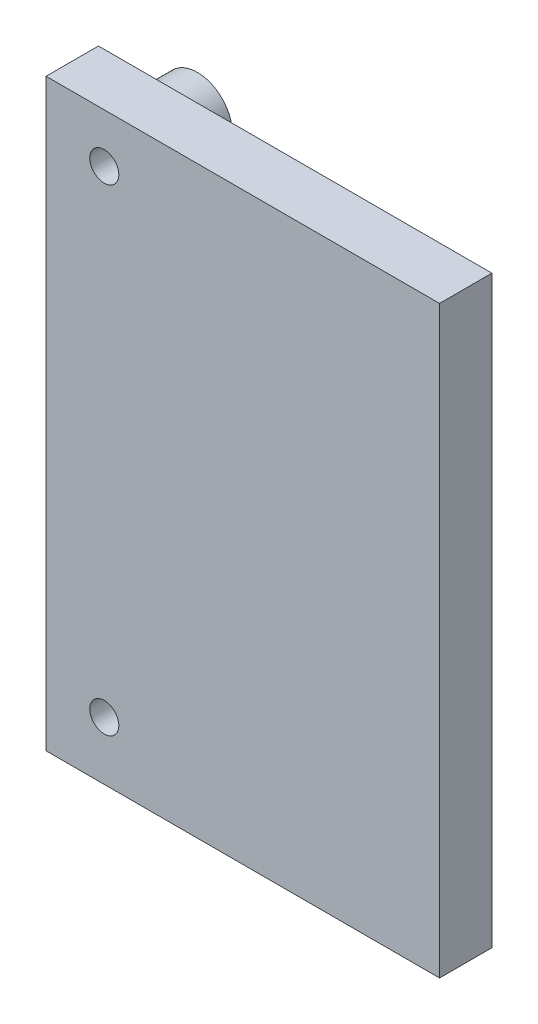
ISO-10303-21;
HEADER;
FILE_DESCRIPTION(('STEP AP214'),'2;1');
FILE_NAME('part.step','',(''),(''),'','','');
FILE_SCHEMA(('AUTOMOTIVE_DESIGN { 1 0 10303 214 1 1 1 1 }'));
ENDSEC;
DATA;
#1=APPLICATION_CONTEXT('core data for automotive mechanical design processes');
#2=APPLICATION_PROTOCOL_DEFINITION('international standard','automotive_design',2000,#1);
#3=PRODUCT_CONTEXT('',#1,'mechanical');
#4=PRODUCT('Part','Part','',(#3));
#5=PRODUCT_RELATED_PRODUCT_CATEGORY('part','',(#4));
#6=PRODUCT_DEFINITION_FORMATION('','',#4);
#7=PRODUCT_DEFINITION_CONTEXT('part definition',#1,'design');
#8=PRODUCT_DEFINITION('design','',#6,#7);
#9=PRODUCT_DEFINITION_SHAPE('','',#8);
#10=(LENGTH_UNIT() NAMED_UNIT(*) SI_UNIT(.MILLI.,.METRE.));
#11=(NAMED_UNIT(*) PLANE_ANGLE_UNIT() SI_UNIT($,.RADIAN.));
#12=(NAMED_UNIT(*) SI_UNIT($,.STERADIAN.) SOLID_ANGLE_UNIT());
#13=UNCERTAINTY_MEASURE_WITH_UNIT(LENGTH_MEASURE(1.E-05),#10,'distance_accuracy_value','');
#14=(GEOMETRIC_REPRESENTATION_CONTEXT(3) GLOBAL_UNCERTAINTY_ASSIGNED_CONTEXT((#13)) GLOBAL_UNIT_ASSIGNED_CONTEXT((#10,
#11,#12)) REPRESENTATION_CONTEXT('',''));
#15=CARTESIAN_POINT('',(0.,0.,0.));
#16=DIRECTION('',(0.,0.,1.));
#17=DIRECTION('',(1.,0.,0.));
#18=AXIS2_PLACEMENT_3D('',#15,#16,#17);
#19=CARTESIAN_POINT('',(81.,-120.,4.5));
#20=DIRECTION('',(1.,0.,0.));
#21=DIRECTION('',(0.,0.,-1.));
#22=AXIS2_PLACEMENT_3D('',#19,#20,#21);
#23=PLANE('',#22);
#24=DIRECTION('',(0.,-1.,0.));
#25=VECTOR('',#24,1.);
#26=CARTESIAN_POINT('',(81.,-120.,0.));
#27=LINE('',#26,#25);
#28=CARTESIAN_POINT('',(81.,-69.7929521045972,0.));
#29=VERTEX_POINT('',#28);
#30=CARTESIAN_POINT('',(81.,-120.,0.));
#31=VERTEX_POINT('',#30);
#32=EDGE_CURVE('E131',#29,#31,#27,.T.);
#33=ORIENTED_EDGE('',*,*,#32,.T.);
#34=DIRECTION('',(0.,0.,-1.));
#35=VECTOR('',#34,1.);
#36=CARTESIAN_POINT('',(81.,-120.,4.5));
#37=LINE('',#36,#35);
#38=CARTESIAN_POINT('',(81.,-120.,4.5));
#39=VERTEX_POINT('',#38);
#40=EDGE_CURVE('E11',#39,#31,#37,.T.);
#41=ORIENTED_EDGE('',*,*,#40,.F.);
#42=DIRECTION('',(0.,-1.,0.));
#43=VECTOR('',#42,1.);
#44=CARTESIAN_POINT('',(81.,-120.,4.5));
#45=LINE('',#44,#43);
#46=CARTESIAN_POINT('',(81.,-69.7929521045972,4.5));
#47=VERTEX_POINT('',#46);
#48=EDGE_CURVE('E142',#47,#39,#45,.T.);
#49=ORIENTED_EDGE('',*,*,#48,.F.);
#50=DIRECTION('',(0.,0.,-1.));
#51=VECTOR('',#50,1.);
#52=CARTESIAN_POINT('',(81.,-69.7929521045972,4.5));
#53=LINE('',#52,#51);
#54=EDGE_CURVE('E155',#47,#29,#53,.T.);
#55=ORIENTED_EDGE('',*,*,#54,.T.);
#56=EDGE_LOOP('',(#33,#41,#49,#55));
#57=FACE_BOUND('',#56,.T.);
#58=ADVANCED_FACE('F43',(#57),#23,.F.);
#59=CARTESIAN_POINT('',(81.,-120.,4.5));
#60=DIRECTION('',(0.,1.,0.));
#61=DIRECTION('',(0.,0.,1.));
#62=AXIS2_PLACEMENT_3D('',#59,#60,#61);
#63=PLANE('',#62);
#64=DIRECTION('',(1.,0.,0.));
#65=VECTOR('',#64,1.);
#66=CARTESIAN_POINT('',(81.,-120.,0.));
#67=LINE('',#66,#65);
#68=CARTESIAN_POINT('',(114.813849948849,-120.,0.));
#69=VERTEX_POINT('',#68);
#70=EDGE_CURVE('E136',#31,#69,#67,.T.);
#71=ORIENTED_EDGE('',*,*,#70,.T.);
#72=DIRECTION('',(0.,0.,-1.));
#73=VECTOR('',#72,1.);
#74=CARTESIAN_POINT('',(114.813849948849,-120.,4.5));
#75=LINE('',#74,#73);
#76=CARTESIAN_POINT('',(114.813849948849,-120.,4.5));
#77=VERTEX_POINT('',#76);
#78=EDGE_CURVE('E51',#77,#69,#75,.T.);
#79=ORIENTED_EDGE('',*,*,#78,.F.);
#80=DIRECTION('',(1.,0.,0.));
#81=VECTOR('',#80,1.);
#82=CARTESIAN_POINT('',(81.,-120.,4.5));
#83=LINE('',#82,#81);
#84=EDGE_CURVE('E146',#39,#77,#83,.T.);
#85=ORIENTED_EDGE('',*,*,#84,.F.);
#86=ORIENTED_EDGE('',*,*,#40,.T.);
#87=EDGE_LOOP('',(#71,#79,#85,#86));
#88=FACE_BOUND('',#87,.T.);
#89=ADVANCED_FACE('F192',(#88),#63,.F.);
#90=CARTESIAN_POINT('',(114.813849948849,-120.,4.5));
#91=DIRECTION('',(-1.,0.,0.));
#92=DIRECTION('',(0.,0.,1.));
#93=AXIS2_PLACEMENT_3D('',#90,#91,#92);
#94=PLANE('',#93);
#95=DIRECTION('',(0.,1.,0.));
#96=VECTOR('',#95,1.);
#97=CARTESIAN_POINT('',(114.813849948849,-120.,0.));
#98=LINE('',#97,#96);
#99=CARTESIAN_POINT('',(114.813849948849,-69.7929521045972,0.));
#100=VERTEX_POINT('',#99);
#101=EDGE_CURVE('E159',#69,#100,#98,.T.);
#102=ORIENTED_EDGE('',*,*,#101,.T.);
#103=DIRECTION('',(0.,0.,-1.));
#104=VECTOR('',#103,1.);
#105=CARTESIAN_POINT('',(114.813849948849,-69.7929521045972,4.5));
#106=LINE('',#105,#104);
#107=CARTESIAN_POINT('',(114.813849948849,-69.7929521045972,4.5));
#108=VERTEX_POINT('',#107);
#109=EDGE_CURVE('E167',#108,#100,#106,.T.);
#110=ORIENTED_EDGE('',*,*,#109,.F.);
#111=DIRECTION('',(0.,1.,0.));
#112=VECTOR('',#111,1.);
#113=CARTESIAN_POINT('',(114.813849948849,-120.,4.5));
#114=LINE('',#113,#112);
#115=EDGE_CURVE('E150',#77,#108,#114,.T.);
#116=ORIENTED_EDGE('',*,*,#115,.F.);
#117=ORIENTED_EDGE('',*,*,#78,.T.);
#118=EDGE_LOOP('',(#102,#110,#116,#117));
#119=FACE_BOUND('',#118,.T.);
#120=ADVANCED_FACE('F176',(#119),#94,.F.);
#121=CARTESIAN_POINT('',(81.,-69.7929521045972,4.5));
#122=DIRECTION('',(0.,-1.,0.));
#123=DIRECTION('',(0.,0.,-1.));
#124=AXIS2_PLACEMENT_3D('',#121,#122,#123);
#125=PLANE('',#124);
#126=DIRECTION('',(-1.,0.,0.));
#127=VECTOR('',#126,1.);
#128=CARTESIAN_POINT('',(81.,-69.7929521045972,0.));
#129=LINE('',#128,#127);
#130=EDGE_CURVE('E147',#100,#29,#129,.T.);
#131=ORIENTED_EDGE('',*,*,#130,.T.);
#132=ORIENTED_EDGE('',*,*,#54,.F.);
#133=DIRECTION('',(-1.,0.,0.));
#134=VECTOR('',#133,1.);
#135=CARTESIAN_POINT('',(81.,-69.7929521045972,4.5));
#136=LINE('',#135,#134);
#137=EDGE_CURVE('E153',#108,#47,#136,.T.);
#138=ORIENTED_EDGE('',*,*,#137,.F.);
#139=ORIENTED_EDGE('',*,*,#109,.T.);
#140=EDGE_LOOP('',(#131,#132,#138,#139));
#141=FACE_BOUND('',#140,.T.);
#142=ADVANCED_FACE('F185',(#141),#125,.F.);
#143=CARTESIAN_POINT('',(0.,0.,4.5));
#144=DIRECTION('',(0.,0.,-1.));
#145=DIRECTION('',(-1.,0.,0.));
#146=AXIS2_PLACEMENT_3D('',#143,#144,#145);
#147=PLANE('',#146);
#148=CARTESIAN_POINT('',(86.,-74.,4.5));
#149=DIRECTION('',(0.,0.,-1.));
#150=DIRECTION('',(-1.,0.,0.));
#151=AXIS2_PLACEMENT_3D('',#148,#149,#150);
#152=CIRCLE('',#151,1.25);
#153=CARTESIAN_POINT('',(84.75,-74.,4.5));
#154=VERTEX_POINT('',#153);
#155=EDGE_CURVE('E250',#154,#154,#152,.T.);
#156=ORIENTED_EDGE('',*,*,#155,.T.);
#157=EDGE_LOOP('',(#156));
#158=FACE_BOUND('',#157,.T.);
#159=CARTESIAN_POINT('',(86.,-115.,4.5));
#160=DIRECTION('',(0.,0.,-1.));
#161=DIRECTION('',(-1.,0.,0.));
#162=AXIS2_PLACEMENT_3D('',#159,#160,#161);
#163=CIRCLE('',#162,1.25);
#164=CARTESIAN_POINT('',(84.75,-115.,4.5));
#165=VERTEX_POINT('',#164);
#166=EDGE_CURVE('E263',#165,#165,#163,.T.);
#167=ORIENTED_EDGE('',*,*,#166,.T.);
#168=EDGE_LOOP('',(#167));
#169=FACE_BOUND('',#168,.T.);
#170=ORIENTED_EDGE('',*,*,#48,.T.);
#171=ORIENTED_EDGE('',*,*,#84,.T.);
#172=ORIENTED_EDGE('',*,*,#115,.T.);
#173=ORIENTED_EDGE('',*,*,#137,.T.);
#174=EDGE_LOOP('',(#170,#171,#172,#173));
#175=FACE_BOUND('',#174,.T.);
#176=ADVANCED_FACE('F191',(#158,#169,#175),#147,.F.);
#177=CARTESIAN_POINT('',(0.,0.,0.));
#178=DIRECTION('',(0.,0.,-1.));
#179=DIRECTION('',(-1.,0.,0.));
#180=AXIS2_PLACEMENT_3D('',#177,#178,#179);
#181=PLANE('',#180);
#182=CARTESIAN_POINT('',(86.,-74.,0.));
#183=DIRECTION('',(0.,0.,-1.));
#184=DIRECTION('',(-1.,0.,0.));
#185=AXIS2_PLACEMENT_3D('',#182,#183,#184);
#186=CIRCLE('',#185,3.00000000000001);
#187=CARTESIAN_POINT('',(83.,-74.,0.));
#188=VERTEX_POINT('',#187);
#189=EDGE_CURVE('E267',#188,#188,#186,.T.);
#190=ORIENTED_EDGE('',*,*,#189,.F.);
#191=EDGE_LOOP('',(#190));
#192=FACE_BOUND('',#191,.T.);
#193=CARTESIAN_POINT('',(86.,-115.,0.));
#194=DIRECTION('',(0.,0.,-1.));
#195=DIRECTION('',(-1.,0.,0.));
#196=AXIS2_PLACEMENT_3D('',#193,#194,#195);
#197=CIRCLE('',#196,3.00000000000001);
#198=CARTESIAN_POINT('',(83.,-115.,0.));
#199=VERTEX_POINT('',#198);
#200=EDGE_CURVE('E272',#199,#199,#197,.T.);
#201=ORIENTED_EDGE('',*,*,#200,.F.);
#202=EDGE_LOOP('',(#201));
#203=FACE_BOUND('',#202,.T.);
#204=DIRECTION('',(0.,-1.,0.));
#205=VECTOR('',#204,1.);
#206=CARTESIAN_POINT('',(112.202559130168,-80.042,0.));
#207=LINE('',#206,#205);
#208=CARTESIAN_POINT('',(112.202559130168,-80.042,0.));
#209=VERTEX_POINT('',#208);
#210=CARTESIAN_POINT('',(112.202559130168,-109.,0.));
#211=VERTEX_POINT('',#210);
#212=EDGE_CURVE('E58',#209,#211,#207,.T.);
#213=ORIENTED_EDGE('',*,*,#212,.F.);
#214=DIRECTION('',(1.,0.,0.));
#215=VECTOR('',#214,1.);
#216=CARTESIAN_POINT('',(112.202559130168,-80.042,0.));
#217=LINE('',#216,#215);
#218=CARTESIAN_POINT('',(85.498,-80.042,0.));
#219=VERTEX_POINT('',#218);
#220=EDGE_CURVE('E62',#219,#209,#217,.T.);
#221=ORIENTED_EDGE('',*,*,#220,.F.);
#222=DIRECTION('',(0.,1.,0.));
#223=VECTOR('',#222,1.);
#224=CARTESIAN_POINT('',(85.498,-80.042,0.));
#225=LINE('',#224,#223);
#226=CARTESIAN_POINT('',(85.498,-109.,0.));
#227=VERTEX_POINT('',#226);
#228=EDGE_CURVE('E293',#227,#219,#225,.T.);
#229=ORIENTED_EDGE('',*,*,#228,.F.);
#230=DIRECTION('',(-1.,0.,0.));
#231=VECTOR('',#230,1.);
#232=CARTESIAN_POINT('',(112.202559130168,-109.,0.));
#233=LINE('',#232,#231);
#234=EDGE_CURVE('E290',#211,#227,#233,.T.);
#235=ORIENTED_EDGE('',*,*,#234,.F.);
#236=EDGE_LOOP('',(#213,#221,#229,#235));
#237=FACE_BOUND('',#236,.T.);
#238=ORIENTED_EDGE('',*,*,#32,.F.);
#239=ORIENTED_EDGE('',*,*,#130,.F.);
#240=ORIENTED_EDGE('',*,*,#101,.F.);
#241=ORIENTED_EDGE('',*,*,#70,.F.);
#242=EDGE_LOOP('',(#238,#239,#240,#241));
#243=FACE_BOUND('',#242,.T.);
#244=ADVANCED_FACE('F182',(#192,#203,#237,#243),#181,.T.);
#245=CARTESIAN_POINT('',(112.202559130168,-80.042,-1.5));
#246=DIRECTION('',(-1.,0.,0.));
#247=DIRECTION('',(0.,0.,1.));
#248=AXIS2_PLACEMENT_3D('',#245,#246,#247);
#249=PLANE('',#248);
#250=ORIENTED_EDGE('',*,*,#212,.T.);
#251=DIRECTION('',(0.,0.,1.));
#252=VECTOR('',#251,1.);
#253=CARTESIAN_POINT('',(112.202559130168,-109.,-1.5));
#254=LINE('',#253,#252);
#255=CARTESIAN_POINT('',(112.202559130168,-109.,-1.5));
#256=VERTEX_POINT('',#255);
#257=EDGE_CURVE('E111',#256,#211,#254,.T.);
#258=ORIENTED_EDGE('',*,*,#257,.F.);
#259=DIRECTION('',(0.,-1.,0.));
#260=VECTOR('',#259,1.);
#261=CARTESIAN_POINT('',(112.202559130168,-80.042,-1.5));
#262=LINE('',#261,#260);
#263=CARTESIAN_POINT('',(112.202559130168,-80.042,-1.5));
#264=VERTEX_POINT('',#263);
#265=EDGE_CURVE('E118',#264,#256,#262,.T.);
#266=ORIENTED_EDGE('',*,*,#265,.F.);
#267=DIRECTION('',(0.,0.,1.));
#268=VECTOR('',#267,1.);
#269=CARTESIAN_POINT('',(112.202559130168,-80.042,-1.5));
#270=LINE('',#269,#268);
#271=EDGE_CURVE('E287',#264,#209,#270,.T.);
#272=ORIENTED_EDGE('',*,*,#271,.T.);
#273=EDGE_LOOP('',(#250,#258,#266,#272));
#274=FACE_BOUND('',#273,.T.);
#275=ADVANCED_FACE('F129',(#274),#249,.F.);
#276=CARTESIAN_POINT('',(112.202559130168,-109.,-1.5));
#277=DIRECTION('',(0.,1.,0.));
#278=DIRECTION('',(0.,0.,1.));
#279=AXIS2_PLACEMENT_3D('',#276,#277,#278);
#280=PLANE('',#279);
#281=ORIENTED_EDGE('',*,*,#234,.T.);
#282=DIRECTION('',(0.,0.,1.));
#283=VECTOR('',#282,1.);
#284=CARTESIAN_POINT('',(85.498,-109.,-1.5));
#285=LINE('',#284,#283);
#286=CARTESIAN_POINT('',(85.498,-109.,-1.5));
#287=VERTEX_POINT('',#286);
#288=EDGE_CURVE('E113',#287,#227,#285,.T.);
#289=ORIENTED_EDGE('',*,*,#288,.F.);
#290=DIRECTION('',(-1.,0.,0.));
#291=VECTOR('',#290,1.);
#292=CARTESIAN_POINT('',(112.202559130168,-109.,-1.5));
#293=LINE('',#292,#291);
#294=EDGE_CURVE('E106',#256,#287,#293,.T.);
#295=ORIENTED_EDGE('',*,*,#294,.F.);
#296=ORIENTED_EDGE('',*,*,#257,.T.);
#297=EDGE_LOOP('',(#281,#289,#295,#296));
#298=FACE_BOUND('',#297,.T.);
#299=ADVANCED_FACE('F109',(#298),#280,.F.);
#300=CARTESIAN_POINT('',(85.498,-80.042,-1.5));
#301=DIRECTION('',(1.,0.,0.));
#302=DIRECTION('',(0.,0.,-1.));
#303=AXIS2_PLACEMENT_3D('',#300,#301,#302);
#304=PLANE('',#303);
#305=ORIENTED_EDGE('',*,*,#228,.T.);
#306=DIRECTION('',(0.,0.,1.));
#307=VECTOR('',#306,1.);
#308=CARTESIAN_POINT('',(85.498,-80.042,-1.5));
#309=LINE('',#308,#307);
#310=CARTESIAN_POINT('',(85.498,-80.042,-1.5));
#311=VERTEX_POINT('',#310);
#312=EDGE_CURVE('E138',#311,#219,#309,.T.);
#313=ORIENTED_EDGE('',*,*,#312,.F.);
#314=DIRECTION('',(0.,1.,0.));
#315=VECTOR('',#314,1.);
#316=CARTESIAN_POINT('',(85.498,-80.042,-1.5));
#317=LINE('',#316,#315);
#318=EDGE_CURVE('E117',#287,#311,#317,.T.);
#319=ORIENTED_EDGE('',*,*,#318,.F.);
#320=ORIENTED_EDGE('',*,*,#288,.T.);
#321=EDGE_LOOP('',(#305,#313,#319,#320));
#322=FACE_BOUND('',#321,.T.);
#323=ADVANCED_FACE('F212',(#322),#304,.F.);
#324=CARTESIAN_POINT('',(112.202559130168,-80.042,-1.5));
#325=DIRECTION('',(0.,-1.,0.));
#326=DIRECTION('',(0.,0.,-1.));
#327=AXIS2_PLACEMENT_3D('',#324,#325,#326);
#328=PLANE('',#327);
#329=ORIENTED_EDGE('',*,*,#220,.T.);
#330=ORIENTED_EDGE('',*,*,#271,.F.);
#331=DIRECTION('',(1.,0.,0.));
#332=VECTOR('',#331,1.);
#333=CARTESIAN_POINT('',(112.202559130168,-80.042,-1.5));
#334=LINE('',#333,#332);
#335=EDGE_CURVE('E123',#311,#264,#334,.T.);
#336=ORIENTED_EDGE('',*,*,#335,.F.);
#337=ORIENTED_EDGE('',*,*,#312,.T.);
#338=EDGE_LOOP('',(#329,#330,#336,#337));
#339=FACE_BOUND('',#338,.T.);
#340=ADVANCED_FACE('F215',(#339),#328,.F.);
#341=CARTESIAN_POINT('',(0.,0.,-1.5));
#342=DIRECTION('',(0.,0.,-1.));
#343=DIRECTION('',(-1.,0.,0.));
#344=AXIS2_PLACEMENT_3D('',#341,#342,#343);
#345=PLANE('',#344);
#346=ORIENTED_EDGE('',*,*,#265,.T.);
#347=ORIENTED_EDGE('',*,*,#294,.T.);
#348=ORIENTED_EDGE('',*,*,#318,.T.);
#349=ORIENTED_EDGE('',*,*,#335,.T.);
#350=EDGE_LOOP('',(#346,#347,#348,#349));
#351=FACE_BOUND('',#350,.T.);
#352=ADVANCED_FACE('F121',(#351),#345,.T.);
#353=CARTESIAN_POINT('',(86.,-115.,-3.5));
#354=DIRECTION('',(0.,0.,1.));
#355=DIRECTION('',(1.,0.,0.));
#356=AXIS2_PLACEMENT_3D('',#353,#354,#355);
#357=CYLINDRICAL_SURFACE('',#356,3.00000000000001);
#358=CARTESIAN_POINT('',(86.,-115.,-3.5));
#359=DIRECTION('',(0.,0.,-1.));
#360=DIRECTION('',(-1.,0.,0.));
#361=AXIS2_PLACEMENT_3D('',#358,#359,#360);
#362=CIRCLE('',#361,3.00000000000001);
#363=CARTESIAN_POINT('',(83.,-115.,-3.5));
#364=VERTEX_POINT('',#363);
#365=EDGE_CURVE('E276',#364,#364,#362,.T.);
#366=ORIENTED_EDGE('',*,*,#365,.F.);
#367=EDGE_LOOP('',(#366));
#368=FACE_BOUND('',#367,.T.);
#369=ORIENTED_EDGE('',*,*,#200,.T.);
#370=EDGE_LOOP('',(#369));
#371=FACE_BOUND('',#370,.T.);
#372=ADVANCED_FACE('F222',(#368,#371),#357,.T.);
#373=CARTESIAN_POINT('',(86.,-115.,-3.5));
#374=DIRECTION('',(0.,0.,-1.));
#375=DIRECTION('',(-1.,0.,0.));
#376=AXIS2_PLACEMENT_3D('',#373,#374,#375);
#377=PLANE('',#376);
#378=CARTESIAN_POINT('',(86.,-115.,-3.5));
#379=DIRECTION('',(0.,0.,-1.));
#380=DIRECTION('',(-1.,0.,0.));
#381=AXIS2_PLACEMENT_3D('',#378,#379,#380);
#382=CIRCLE('',#381,1.25);
#383=CARTESIAN_POINT('',(84.75,-115.,-3.5));
#384=VERTEX_POINT('',#383);
#385=EDGE_CURVE('E257',#384,#384,#382,.T.);
#386=ORIENTED_EDGE('',*,*,#385,.F.);
#387=EDGE_LOOP('',(#386));
#388=FACE_BOUND('',#387,.T.);
#389=ORIENTED_EDGE('',*,*,#365,.T.);
#390=EDGE_LOOP('',(#389));
#391=FACE_BOUND('',#390,.T.);
#392=ADVANCED_FACE('F225',(#388,#391),#377,.T.);
#393=CARTESIAN_POINT('',(86.,-74.,-3.5));
#394=DIRECTION('',(0.,0.,1.));
#395=DIRECTION('',(1.,0.,0.));
#396=AXIS2_PLACEMENT_3D('',#393,#394,#395);
#397=CYLINDRICAL_SURFACE('',#396,3.00000000000001);
#398=CARTESIAN_POINT('',(86.,-74.,-3.5));
#399=DIRECTION('',(0.,0.,-1.));
#400=DIRECTION('',(-1.,0.,0.));
#401=AXIS2_PLACEMENT_3D('',#398,#399,#400);
#402=CIRCLE('',#401,3.00000000000001);
#403=CARTESIAN_POINT('',(83.,-74.,-3.5));
#404=VERTEX_POINT('',#403);
#405=EDGE_CURVE('E268',#404,#404,#402,.T.);
#406=ORIENTED_EDGE('',*,*,#405,.F.);
#407=EDGE_LOOP('',(#406));
#408=FACE_BOUND('',#407,.T.);
#409=ORIENTED_EDGE('',*,*,#189,.T.);
#410=EDGE_LOOP('',(#409));
#411=FACE_BOUND('',#410,.T.);
#412=ADVANCED_FACE('F229',(#408,#411),#397,.T.);
#413=CARTESIAN_POINT('',(86.,-74.,-3.5));
#414=DIRECTION('',(0.,0.,-1.));
#415=DIRECTION('',(-1.,0.,0.));
#416=AXIS2_PLACEMENT_3D('',#413,#414,#415);
#417=PLANE('',#416);
#418=CARTESIAN_POINT('',(86.,-74.,-3.5));
#419=DIRECTION('',(0.,0.,-1.));
#420=DIRECTION('',(-1.,0.,0.));
#421=AXIS2_PLACEMENT_3D('',#418,#419,#420);
#422=CIRCLE('',#421,1.25);
#423=CARTESIAN_POINT('',(84.75,-74.,-3.5));
#424=VERTEX_POINT('',#423);
#425=EDGE_CURVE('E253',#424,#424,#422,.T.);
#426=ORIENTED_EDGE('',*,*,#425,.F.);
#427=EDGE_LOOP('',(#426));
#428=FACE_BOUND('',#427,.T.);
#429=ORIENTED_EDGE('',*,*,#405,.T.);
#430=EDGE_LOOP('',(#429));
#431=FACE_BOUND('',#430,.T.);
#432=ADVANCED_FACE('F233',(#428,#431),#417,.T.);
#433=CARTESIAN_POINT('',(86.,-115.,-3.5));
#434=DIRECTION('',(0.,0.,-1.));
#435=DIRECTION('',(-1.,0.,0.));
#436=AXIS2_PLACEMENT_3D('',#433,#434,#435);
#437=CYLINDRICAL_SURFACE('',#436,1.25);
#438=ORIENTED_EDGE('',*,*,#166,.F.);
#439=EDGE_LOOP('',(#438));
#440=FACE_BOUND('',#439,.T.);
#441=ORIENTED_EDGE('',*,*,#385,.T.);
#442=EDGE_LOOP('',(#441));
#443=FACE_BOUND('',#442,.T.);
#444=ADVANCED_FACE('F237',(#440,#443),#437,.F.);
#445=CARTESIAN_POINT('',(86.,-74.,-3.5));
#446=DIRECTION('',(0.,0.,-1.));
#447=DIRECTION('',(-1.,0.,0.));
#448=AXIS2_PLACEMENT_3D('',#445,#446,#447);
#449=CYLINDRICAL_SURFACE('',#448,1.25);
#450=ORIENTED_EDGE('',*,*,#155,.F.);
#451=EDGE_LOOP('',(#450));
#452=FACE_BOUND('',#451,.T.);
#453=ORIENTED_EDGE('',*,*,#425,.T.);
#454=EDGE_LOOP('',(#453));
#455=FACE_BOUND('',#454,.T.);
#456=ADVANCED_FACE('F241',(#452,#455),#449,.F.);
#457=CLOSED_SHELL('',(#58,#89,#120,#142,#176,#244,#275,#299,#323,#340,#352,#372,#392,#412,#432,
#444,#456));
#458=MANIFOLD_SOLID_BREP('B2',#457);
#459=ADVANCED_BREP_SHAPE_REPRESENTATION('',(#18,#458),#14);
#460=SHAPE_DEFINITION_REPRESENTATION(#9,#459);
ENDSEC;
END-ISO-10303-21;
